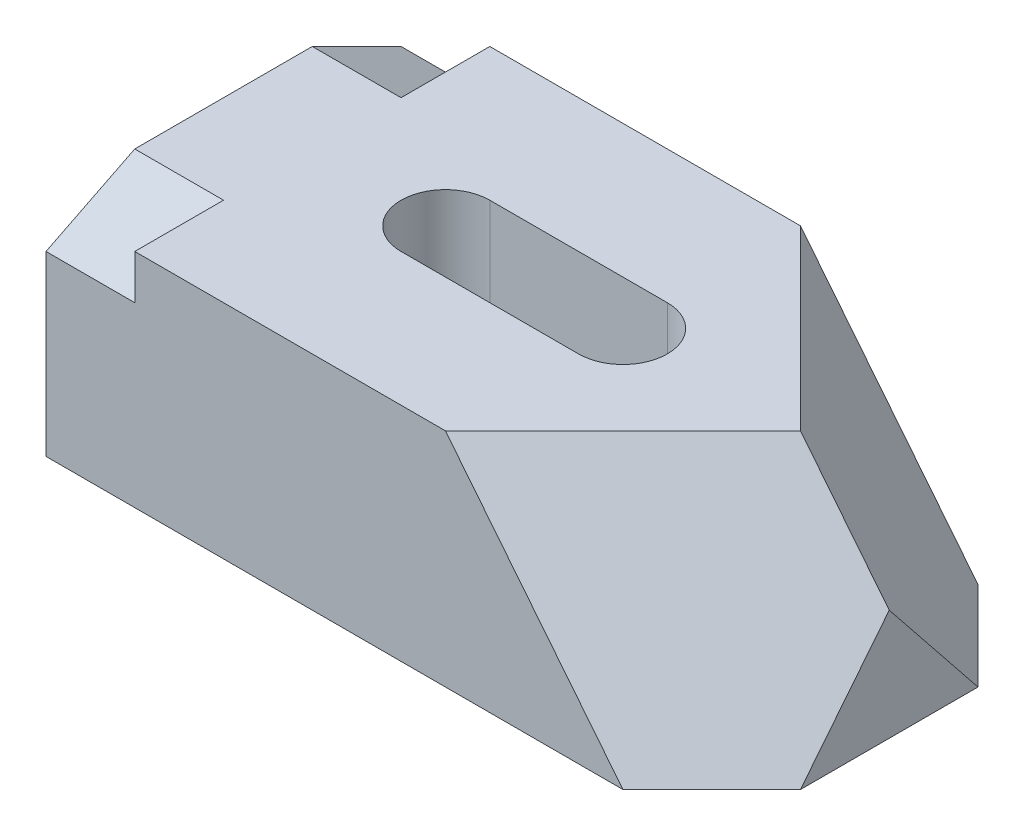
ISO-10303-21;
HEADER;
FILE_DESCRIPTION(('STEP AP214'),'2;1');
FILE_NAME('part.step','',(''),(''),'','','');
FILE_SCHEMA(('AUTOMOTIVE_DESIGN { 1 0 10303 214 1 1 1 1 }'));
ENDSEC;
DATA;
#1=APPLICATION_CONTEXT('core data for automotive mechanical design processes');
#2=APPLICATION_PROTOCOL_DEFINITION('international standard','automotive_design',2000,#1);
#3=PRODUCT_CONTEXT('',#1,'mechanical');
#4=PRODUCT('Part','Part','',(#3));
#5=PRODUCT_RELATED_PRODUCT_CATEGORY('part','',(#4));
#6=PRODUCT_DEFINITION_FORMATION('','',#4);
#7=PRODUCT_DEFINITION_CONTEXT('part definition',#1,'design');
#8=PRODUCT_DEFINITION('design','',#6,#7);
#9=PRODUCT_DEFINITION_SHAPE('','',#8);
#10=(LENGTH_UNIT() NAMED_UNIT(*) SI_UNIT(.MILLI.,.METRE.));
#11=(NAMED_UNIT(*) PLANE_ANGLE_UNIT() SI_UNIT($,.RADIAN.));
#12=(NAMED_UNIT(*) SI_UNIT($,.STERADIAN.) SOLID_ANGLE_UNIT());
#13=UNCERTAINTY_MEASURE_WITH_UNIT(LENGTH_MEASURE(1.E-05),#10,'distance_accuracy_value','');
#14=(GEOMETRIC_REPRESENTATION_CONTEXT(3) GLOBAL_UNCERTAINTY_ASSIGNED_CONTEXT((#13)) GLOBAL_UNIT_ASSIGNED_CONTEXT((#10,
#11,#12)) REPRESENTATION_CONTEXT('',''));
#15=CARTESIAN_POINT('',(0.,0.,0.));
#16=DIRECTION('',(0.,0.,1.));
#17=DIRECTION('',(1.,0.,0.));
#18=AXIS2_PLACEMENT_3D('',#15,#16,#17);
#19=CARTESIAN_POINT('',(45.,0.,-20.));
#20=DIRECTION('',(0.,1.,0.));
#21=DIRECTION('',(0.,0.,1.));
#22=AXIS2_PLACEMENT_3D('',#19,#20,#21);
#23=CYLINDRICAL_SURFACE('',#22,5.);
#24=DIRECTION('',(0.,1.,0.));
#25=VECTOR('',#24,1.);
#26=CARTESIAN_POINT('',(45.,0.,-15.));
#27=LINE('',#26,#25);
#28=CARTESIAN_POINT('',(45.,0.,-15.));
#29=VERTEX_POINT('',#28);
#30=CARTESIAN_POINT('',(45.,25.,-15.));
#31=VERTEX_POINT('',#30);
#32=EDGE_CURVE('E448',#29,#31,#27,.T.);
#33=ORIENTED_EDGE('',*,*,#32,.T.);
#34=CARTESIAN_POINT('',(45.,25.,-20.));
#35=DIRECTION('',(0.,1.,0.));
#36=DIRECTION('',(0.,0.,1.));
#37=AXIS2_PLACEMENT_3D('',#34,#35,#36);
#38=CIRCLE('',#37,5.);
#39=CARTESIAN_POINT('',(45.,25.,-25.));
#40=VERTEX_POINT('',#39);
#41=EDGE_CURVE('E174',#31,#40,#38,.T.);
#42=ORIENTED_EDGE('',*,*,#41,.T.);
#43=DIRECTION('',(0.,1.,0.));
#44=VECTOR('',#43,1.);
#45=CARTESIAN_POINT('',(45.,0.,-25.));
#46=LINE('',#45,#44);
#47=CARTESIAN_POINT('',(45.,0.,-25.));
#48=VERTEX_POINT('',#47);
#49=EDGE_CURVE('E148',#48,#40,#46,.T.);
#50=ORIENTED_EDGE('',*,*,#49,.F.);
#51=CARTESIAN_POINT('',(45.,0.,-20.));
#52=DIRECTION('',(0.,1.,0.));
#53=DIRECTION('',(0.,0.,1.));
#54=AXIS2_PLACEMENT_3D('',#51,#52,#53);
#55=CIRCLE('',#54,5.);
#56=EDGE_CURVE('E158',#29,#48,#55,.T.);
#57=ORIENTED_EDGE('',*,*,#56,.F.);
#58=EDGE_LOOP('',(#33,#42,#50,#57));
#59=FACE_BOUND('',#58,.T.);
#60=ADVANCED_FACE('F39',(#59),#23,.F.);
#61=CARTESIAN_POINT('',(0.,25.,0.));
#62=DIRECTION('',(0.,0.,-1.));
#63=DIRECTION('',(-1.,0.,0.));
#64=AXIS2_PLACEMENT_3D('',#61,#62,#63);
#65=PLANE('',#64);
#66=DIRECTION('',(0.,1.,0.));
#67=VECTOR('',#66,1.);
#68=CARTESIAN_POINT('',(10.,20.,0.));
#69=LINE('',#68,#67);
#70=CARTESIAN_POINT('',(10.,20.,0.));
#71=VERTEX_POINT('',#70);
#72=CARTESIAN_POINT('',(10.,25.,0.));
#73=VERTEX_POINT('',#72);
#74=EDGE_CURVE('E203',#71,#73,#69,.T.);
#75=ORIENTED_EDGE('',*,*,#74,.F.);
#76=DIRECTION('',(-1.,0.,0.));
#77=VECTOR('',#76,1.);
#78=CARTESIAN_POINT('',(10.,20.,0.));
#79=LINE('',#78,#77);
#80=CARTESIAN_POINT('',(0.,20.,0.));
#81=VERTEX_POINT('',#80);
#82=EDGE_CURVE('E209',#71,#81,#79,.T.);
#83=ORIENTED_EDGE('',*,*,#82,.T.);
#84=DIRECTION('',(0.,-1.,0.));
#85=VECTOR('',#84,1.);
#86=CARTESIAN_POINT('',(0.,25.,0.));
#87=LINE('',#86,#85);
#88=CARTESIAN_POINT('',(0.,0.,0.));
#89=VERTEX_POINT('',#88);
#90=EDGE_CURVE('E271',#81,#89,#87,.T.);
#91=ORIENTED_EDGE('',*,*,#90,.T.);
#92=DIRECTION('',(1.,0.,0.));
#93=VECTOR('',#92,1.);
#94=CARTESIAN_POINT('',(0.,0.,0.));
#95=LINE('',#94,#93);
#96=CARTESIAN_POINT('',(65.,0.,0.));
#97=VERTEX_POINT('',#96);
#98=EDGE_CURVE('E258',#89,#97,#95,.T.);
#99=ORIENTED_EDGE('',*,*,#98,.T.);
#100=DIRECTION('',(0.624695047554425,-0.78086880944303,0.));
#101=VECTOR('',#100,1.);
#102=CARTESIAN_POINT('',(27.4390243902439,46.9512195121951,0.));
#103=LINE('',#102,#101);
#104=CARTESIAN_POINT('',(45.,25.,0.));
#105=VERTEX_POINT('',#104);
#106=EDGE_CURVE('E235',#105,#97,#103,.T.);
#107=ORIENTED_EDGE('',*,*,#106,.F.);
#108=DIRECTION('',(1.,0.,0.));
#109=VECTOR('',#108,1.);
#110=CARTESIAN_POINT('',(0.,25.,0.));
#111=LINE('',#110,#109);
#112=EDGE_CURVE('E246',#73,#105,#111,.T.);
#113=ORIENTED_EDGE('',*,*,#112,.F.);
#114=EDGE_LOOP('',(#75,#83,#91,#99,#107,#113));
#115=FACE_BOUND('',#114,.T.);
#116=ADVANCED_FACE('F284',(#115),#65,.F.);
#117=CARTESIAN_POINT('',(75.,25.,0.));
#118=DIRECTION('',(-1.,0.,0.));
#119=DIRECTION('',(0.,0.,1.));
#120=AXIS2_PLACEMENT_3D('',#117,#118,#119);
#121=PLANE('',#120);
#122=DIRECTION('',(0.,0.,-1.));
#123=VECTOR('',#122,1.);
#124=CARTESIAN_POINT('',(75.,0.,0.));
#125=LINE('',#124,#123);
#126=CARTESIAN_POINT('',(75.,0.,-9.99999999999997));
#127=VERTEX_POINT('',#126);
#128=CARTESIAN_POINT('',(75.,0.,-30.));
#129=VERTEX_POINT('',#128);
#130=EDGE_CURVE('E262',#127,#129,#125,.T.);
#131=ORIENTED_EDGE('',*,*,#130,.T.);
#132=DIRECTION('',(0.,0.780868809443029,0.624695047554426));
#133=VECTOR('',#132,1.);
#134=CARTESIAN_POINT('',(75.,29.8780487804878,-6.09756097560968));
#135=LINE('',#134,#133);
#136=CARTESIAN_POINT('',(75.,12.5,-20.));
#137=VERTEX_POINT('',#136);
#138=EDGE_CURVE('E220',#129,#137,#135,.T.);
#139=ORIENTED_EDGE('',*,*,#138,.T.);
#140=DIRECTION('',(0.,0.78086880944303,-0.624695047554425));
#141=VECTOR('',#140,1.);
#142=CARTESIAN_POINT('',(75.,10.3658536585366,-18.2926829268293));
#143=LINE('',#142,#141);
#144=EDGE_CURVE('E231',#127,#137,#143,.T.);
#145=ORIENTED_EDGE('',*,*,#144,.F.);
#146=EDGE_LOOP('',(#131,#139,#145));
#147=FACE_BOUND('',#146,.T.);
#148=ADVANCED_FACE('F308',(#147),#121,.F.);
#149=CARTESIAN_POINT('',(0.,25.,0.));
#150=DIRECTION('',(0.,-1.,0.));
#151=DIRECTION('',(0.,0.,-1.));
#152=AXIS2_PLACEMENT_3D('',#149,#150,#151);
#153=PLANE('',#152);
#154=ORIENTED_EDGE('',*,*,#41,.F.);
#155=DIRECTION('',(1.,0.,0.));
#156=VECTOR('',#155,1.);
#157=CARTESIAN_POINT('',(45.,25.,-15.));
#158=LINE('',#157,#156);
#159=CARTESIAN_POINT('',(25.,25.,-15.));
#160=VERTEX_POINT('',#159);
#161=EDGE_CURVE('E55',#160,#31,#158,.T.);
#162=ORIENTED_EDGE('',*,*,#161,.F.);
#163=CARTESIAN_POINT('',(25.,25.,-20.));
#164=DIRECTION('',(0.,1.,0.));
#165=DIRECTION('',(0.,0.,1.));
#166=AXIS2_PLACEMENT_3D('',#163,#164,#165);
#167=CIRCLE('',#166,5.);
#168=CARTESIAN_POINT('',(25.,25.,-25.));
#169=VERTEX_POINT('',#168);
#170=EDGE_CURVE('E166',#169,#160,#167,.T.);
#171=ORIENTED_EDGE('',*,*,#170,.F.);
#172=DIRECTION('',(-1.,0.,0.));
#173=VECTOR('',#172,1.);
#174=CARTESIAN_POINT('',(45.,25.,-25.));
#175=LINE('',#174,#173);
#176=EDGE_CURVE('E141',#40,#169,#175,.T.);
#177=ORIENTED_EDGE('',*,*,#176,.F.);
#178=EDGE_LOOP('',(#154,#162,#171,#177));
#179=FACE_BOUND('',#178,.T.);
#180=DIRECTION('',(0.,0.,-1.));
#181=VECTOR('',#180,1.);
#182=CARTESIAN_POINT('',(10.,25.,-30.));
#183=LINE('',#182,#181);
#184=CARTESIAN_POINT('',(10.,25.,-30.));
#185=VERTEX_POINT('',#184);
#186=CARTESIAN_POINT('',(10.,25.,-40.));
#187=VERTEX_POINT('',#186);
#188=EDGE_CURVE('E184',#185,#187,#183,.T.);
#189=ORIENTED_EDGE('',*,*,#188,.F.);
#190=DIRECTION('',(-1.,0.,0.));
#191=VECTOR('',#190,1.);
#192=CARTESIAN_POINT('',(10.,25.,-30.));
#193=LINE('',#192,#191);
#194=CARTESIAN_POINT('',(0.,25.,-30.));
#195=VERTEX_POINT('',#194);
#196=EDGE_CURVE('E188',#185,#195,#193,.T.);
#197=ORIENTED_EDGE('',*,*,#196,.T.);
#198=DIRECTION('',(0.,0.,1.));
#199=VECTOR('',#198,1.);
#200=CARTESIAN_POINT('',(0.,25.,0.));
#201=LINE('',#200,#199);
#202=CARTESIAN_POINT('',(0.,25.,-10.));
#203=VERTEX_POINT('',#202);
#204=EDGE_CURVE('E243',#195,#203,#201,.T.);
#205=ORIENTED_EDGE('',*,*,#204,.T.);
#206=DIRECTION('',(-1.,0.,0.));
#207=VECTOR('',#206,1.);
#208=CARTESIAN_POINT('',(10.,25.,-10.));
#209=LINE('',#208,#207);
#210=CARTESIAN_POINT('',(10.,25.,-10.));
#211=VERTEX_POINT('',#210);
#212=EDGE_CURVE('E206',#211,#203,#209,.T.);
#213=ORIENTED_EDGE('',*,*,#212,.F.);
#214=DIRECTION('',(0.,0.,-1.));
#215=VECTOR('',#214,1.);
#216=CARTESIAN_POINT('',(10.,25.,0.));
#217=LINE('',#216,#215);
#218=EDGE_CURVE('E195',#73,#211,#217,.T.);
#219=ORIENTED_EDGE('',*,*,#218,.F.);
#220=ORIENTED_EDGE('',*,*,#112,.T.);
#221=DIRECTION('',(-0.707106781186547,0.,0.707106781186548));
#222=VECTOR('',#221,1.);
#223=CARTESIAN_POINT('',(22.5,25.,22.5));
#224=LINE('',#223,#222);
#225=CARTESIAN_POINT('',(65.,25.,-20.));
#226=VERTEX_POINT('',#225);
#227=EDGE_CURVE('E238',#226,#105,#224,.T.);
#228=ORIENTED_EDGE('',*,*,#227,.F.);
#229=DIRECTION('',(-0.707106781186546,0.,-0.707106781186549));
#230=VECTOR('',#229,1.);
#231=CARTESIAN_POINT('',(42.5000000000001,25.,-42.4999999999999));
#232=LINE('',#231,#230);
#233=CARTESIAN_POINT('',(45.,25.,-40.));
#234=VERTEX_POINT('',#233);
#235=EDGE_CURVE('E213',#226,#234,#232,.T.);
#236=ORIENTED_EDGE('',*,*,#235,.T.);
#237=DIRECTION('',(-1.,0.,0.));
#238=VECTOR('',#237,1.);
#239=CARTESIAN_POINT('',(0.,25.,-40.));
#240=LINE('',#239,#238);
#241=EDGE_CURVE('E250',#234,#187,#240,.T.);
#242=ORIENTED_EDGE('',*,*,#241,.T.);
#243=EDGE_LOOP('',(#189,#197,#205,#213,#219,#220,#228,#236,#242));
#244=FACE_BOUND('',#243,.T.);
#245=ADVANCED_FACE('F304',(#179,#244),#153,.F.);
#246=CARTESIAN_POINT('',(0.,0.,0.));
#247=DIRECTION('',(0.,-1.,0.));
#248=DIRECTION('',(0.,0.,-1.));
#249=AXIS2_PLACEMENT_3D('',#246,#247,#248);
#250=PLANE('',#249);
#251=DIRECTION('',(1.,0.,0.));
#252=VECTOR('',#251,1.);
#253=CARTESIAN_POINT('',(45.,0.,-15.));
#254=LINE('',#253,#252);
#255=CARTESIAN_POINT('',(25.,0.,-15.));
#256=VERTEX_POINT('',#255);
#257=EDGE_CURVE('E160',#256,#29,#254,.T.);
#258=ORIENTED_EDGE('',*,*,#257,.T.);
#259=ORIENTED_EDGE('',*,*,#56,.T.);
#260=DIRECTION('',(-1.,0.,0.));
#261=VECTOR('',#260,1.);
#262=CARTESIAN_POINT('',(45.,0.,-25.));
#263=LINE('',#262,#261);
#264=CARTESIAN_POINT('',(25.,0.,-25.));
#265=VERTEX_POINT('',#264);
#266=EDGE_CURVE('E63',#48,#265,#263,.T.);
#267=ORIENTED_EDGE('',*,*,#266,.T.);
#268=CARTESIAN_POINT('',(25.,0.,-20.));
#269=DIRECTION('',(0.,1.,0.));
#270=DIRECTION('',(0.,0.,1.));
#271=AXIS2_PLACEMENT_3D('',#268,#269,#270);
#272=CIRCLE('',#271,5.);
#273=EDGE_CURVE('E156',#265,#256,#272,.T.);
#274=ORIENTED_EDGE('',*,*,#273,.T.);
#275=EDGE_LOOP('',(#258,#259,#267,#274));
#276=FACE_BOUND('',#275,.T.);
#277=DIRECTION('',(-0.707106781186546,0.,-0.707106781186549));
#278=VECTOR('',#277,1.);
#279=CARTESIAN_POINT('',(52.5000000000001,0.,-52.4999999999999));
#280=LINE('',#279,#278);
#281=CARTESIAN_POINT('',(65.,0.,-40.));
#282=VERTEX_POINT('',#281);
#283=EDGE_CURVE('E228',#129,#282,#280,.T.);
#284=ORIENTED_EDGE('',*,*,#283,.F.);
#285=ORIENTED_EDGE('',*,*,#130,.F.);
#286=DIRECTION('',(-0.707106781186547,0.,0.707106781186548));
#287=VECTOR('',#286,1.);
#288=CARTESIAN_POINT('',(32.5,0.,32.5));
#289=LINE('',#288,#287);
#290=EDGE_CURVE('E48',#127,#97,#289,.T.);
#291=ORIENTED_EDGE('',*,*,#290,.T.);
#292=ORIENTED_EDGE('',*,*,#98,.F.);
#293=DIRECTION('',(0.,0.,1.));
#294=VECTOR('',#293,1.);
#295=CARTESIAN_POINT('',(0.,0.,0.));
#296=LINE('',#295,#294);
#297=CARTESIAN_POINT('',(0.,0.,-40.));
#298=VERTEX_POINT('',#297);
#299=EDGE_CURVE('E242',#298,#89,#296,.T.);
#300=ORIENTED_EDGE('',*,*,#299,.F.);
#301=DIRECTION('',(-1.,0.,0.));
#302=VECTOR('',#301,1.);
#303=CARTESIAN_POINT('',(0.,0.,-40.));
#304=LINE('',#303,#302);
#305=EDGE_CURVE('E247',#282,#298,#304,.T.);
#306=ORIENTED_EDGE('',*,*,#305,.F.);
#307=EDGE_LOOP('',(#284,#285,#291,#292,#300,#306));
#308=FACE_BOUND('',#307,.T.);
#309=ADVANCED_FACE('F154',(#276,#308),#250,.T.);
#310=CARTESIAN_POINT('',(0.,25.,0.));
#311=DIRECTION('',(1.,0.,0.));
#312=DIRECTION('',(0.,0.,-1.));
#313=AXIS2_PLACEMENT_3D('',#310,#311,#312);
#314=PLANE('',#313);
#315=ORIENTED_EDGE('',*,*,#204,.F.);
#316=DIRECTION('',(0.,0.447213595499958,0.894427190999916));
#317=VECTOR('',#316,1.);
#318=CARTESIAN_POINT('',(0.,20.,-40.));
#319=LINE('',#318,#317);
#320=CARTESIAN_POINT('',(0.,20.,-40.));
#321=VERTEX_POINT('',#320);
#322=EDGE_CURVE('E165',#321,#195,#319,.T.);
#323=ORIENTED_EDGE('',*,*,#322,.F.);
#324=DIRECTION('',(0.,-1.,0.));
#325=VECTOR('',#324,1.);
#326=CARTESIAN_POINT('',(0.,25.,-40.));
#327=LINE('',#326,#325);
#328=EDGE_CURVE('E254',#321,#298,#327,.T.);
#329=ORIENTED_EDGE('',*,*,#328,.T.);
#330=ORIENTED_EDGE('',*,*,#299,.T.);
#331=ORIENTED_EDGE('',*,*,#90,.F.);
#332=DIRECTION('',(0.,-0.447213595499958,0.894427190999916));
#333=VECTOR('',#332,1.);
#334=CARTESIAN_POINT('',(0.,25.,-10.));
#335=LINE('',#334,#333);
#336=EDGE_CURVE('E192',#203,#81,#335,.T.);
#337=ORIENTED_EDGE('',*,*,#336,.F.);
#338=EDGE_LOOP('',(#315,#323,#329,#330,#331,#337));
#339=FACE_BOUND('',#338,.T.);
#340=ADVANCED_FACE('F41',(#339),#314,.F.);
#341=CARTESIAN_POINT('',(0.,25.,-40.));
#342=DIRECTION('',(0.,0.,1.));
#343=DIRECTION('',(1.,0.,0.));
#344=AXIS2_PLACEMENT_3D('',#341,#342,#343);
#345=PLANE('',#344);
#346=ORIENTED_EDGE('',*,*,#328,.F.);
#347=DIRECTION('',(-1.,0.,0.));
#348=VECTOR('',#347,1.);
#349=CARTESIAN_POINT('',(10.,20.,-40.));
#350=LINE('',#349,#348);
#351=CARTESIAN_POINT('',(10.,20.,-40.));
#352=VERTEX_POINT('',#351);
#353=EDGE_CURVE('E186',#352,#321,#350,.T.);
#354=ORIENTED_EDGE('',*,*,#353,.F.);
#355=DIRECTION('',(0.,-1.,0.));
#356=VECTOR('',#355,1.);
#357=CARTESIAN_POINT('',(10.,25.,-40.));
#358=LINE('',#357,#356);
#359=EDGE_CURVE('E170',#187,#352,#358,.T.);
#360=ORIENTED_EDGE('',*,*,#359,.F.);
#361=ORIENTED_EDGE('',*,*,#241,.F.);
#362=DIRECTION('',(0.624695047554425,-0.78086880944303,0.));
#363=VECTOR('',#362,1.);
#364=CARTESIAN_POINT('',(27.4390243902439,46.9512195121951,-40.));
#365=LINE('',#364,#363);
#366=EDGE_CURVE('E224',#234,#282,#365,.T.);
#367=ORIENTED_EDGE('',*,*,#366,.T.);
#368=ORIENTED_EDGE('',*,*,#305,.T.);
#369=EDGE_LOOP('',(#346,#354,#360,#361,#367,#368));
#370=FACE_BOUND('',#369,.T.);
#371=ADVANCED_FACE('F294',(#370),#345,.F.);
#372=CARTESIAN_POINT('',(24.6212121212121,19.6969696969697,24.6212121212121));
#373=DIRECTION('',(0.615457454896664,0.492365963917331,0.615457454896663));
#374=DIRECTION('',(0.707106781186547,0.,-0.707106781186548));
#375=AXIS2_PLACEMENT_3D('',#372,#373,#374);
#376=PLANE('',#375);
#377=DIRECTION('',(0.624695047554425,-0.78086880944303,0.));
#378=VECTOR('',#377,1.);
#379=CARTESIAN_POINT('',(51.8292682926829,41.4634146341463,-20.));
#380=LINE('',#379,#378);
#381=EDGE_CURVE('E11',#226,#137,#380,.T.);
#382=ORIENTED_EDGE('',*,*,#381,.F.);
#383=ORIENTED_EDGE('',*,*,#227,.T.);
#384=ORIENTED_EDGE('',*,*,#106,.T.);
#385=ORIENTED_EDGE('',*,*,#290,.F.);
#386=ORIENTED_EDGE('',*,*,#144,.T.);
#387=EDGE_LOOP('',(#382,#383,#384,#385,#386));
#388=FACE_BOUND('',#387,.T.);
#389=ADVANCED_FACE('F306',(#388),#376,.T.);
#390=CARTESIAN_POINT('',(39.7727272727273,31.8181818181819,-39.7727272727272));
#391=DIRECTION('',(-0.615457454896664,-0.492365963917332,0.615457454896662));
#392=DIRECTION('',(0.707106781186546,0.,0.707106781186549));
#393=AXIS2_PLACEMENT_3D('',#390,#391,#392);
#394=PLANE('',#393);
#395=ORIENTED_EDGE('',*,*,#283,.T.);
#396=ORIENTED_EDGE('',*,*,#366,.F.);
#397=ORIENTED_EDGE('',*,*,#235,.F.);
#398=ORIENTED_EDGE('',*,*,#381,.T.);
#399=ORIENTED_EDGE('',*,*,#138,.F.);
#400=EDGE_LOOP('',(#395,#396,#397,#398,#399));
#401=FACE_BOUND('',#400,.T.);
#402=ADVANCED_FACE('F299',(#401),#394,.F.);
#403=CARTESIAN_POINT('',(10.,25.,-10.));
#404=DIRECTION('',(0.,-0.894427190999916,-0.447213595499958));
#405=DIRECTION('',(0.,0.447213595499958,-0.894427190999916));
#406=AXIS2_PLACEMENT_3D('',#403,#404,#405);
#407=PLANE('',#406);
#408=ORIENTED_EDGE('',*,*,#336,.T.);
#409=ORIENTED_EDGE('',*,*,#82,.F.);
#410=DIRECTION('',(0.,-0.447213595499958,0.894427190999916));
#411=VECTOR('',#410,1.);
#412=CARTESIAN_POINT('',(10.,25.,-10.));
#413=LINE('',#412,#411);
#414=EDGE_CURVE('E199',#211,#71,#413,.T.);
#415=ORIENTED_EDGE('',*,*,#414,.F.);
#416=ORIENTED_EDGE('',*,*,#212,.T.);
#417=EDGE_LOOP('',(#408,#409,#415,#416));
#418=FACE_BOUND('',#417,.T.);
#419=ADVANCED_FACE('F339',(#418),#407,.F.);
#420=CARTESIAN_POINT('',(10.,0.,0.));
#421=DIRECTION('',(1.,0.,0.));
#422=DIRECTION('',(0.,0.,-1.));
#423=AXIS2_PLACEMENT_3D('',#420,#421,#422);
#424=PLANE('',#423);
#425=ORIENTED_EDGE('',*,*,#218,.T.);
#426=ORIENTED_EDGE('',*,*,#414,.T.);
#427=ORIENTED_EDGE('',*,*,#74,.T.);
#428=EDGE_LOOP('',(#425,#426,#427));
#429=FACE_BOUND('',#428,.T.);
#430=ADVANCED_FACE('F335',(#429),#424,.F.);
#431=CARTESIAN_POINT('',(10.,20.,-40.));
#432=DIRECTION('',(0.,-0.894427190999916,0.447213595499958));
#433=DIRECTION('',(0.,-0.447213595499958,-0.894427190999916));
#434=AXIS2_PLACEMENT_3D('',#431,#432,#433);
#435=PLANE('',#434);
#436=ORIENTED_EDGE('',*,*,#322,.T.);
#437=ORIENTED_EDGE('',*,*,#196,.F.);
#438=DIRECTION('',(0.,0.447213595499958,0.894427190999916));
#439=VECTOR('',#438,1.);
#440=CARTESIAN_POINT('',(10.,20.,-40.));
#441=LINE('',#440,#439);
#442=EDGE_CURVE('E180',#352,#185,#441,.T.);
#443=ORIENTED_EDGE('',*,*,#442,.F.);
#444=ORIENTED_EDGE('',*,*,#353,.T.);
#445=EDGE_LOOP('',(#436,#437,#443,#444));
#446=FACE_BOUND('',#445,.T.);
#447=ADVANCED_FACE('F331',(#446),#435,.F.);
#448=CARTESIAN_POINT('',(10.,0.,0.));
#449=DIRECTION('',(1.,0.,0.));
#450=DIRECTION('',(0.,0.,-1.));
#451=AXIS2_PLACEMENT_3D('',#448,#449,#450);
#452=PLANE('',#451);
#453=ORIENTED_EDGE('',*,*,#359,.T.);
#454=ORIENTED_EDGE('',*,*,#442,.T.);
#455=ORIENTED_EDGE('',*,*,#188,.T.);
#456=EDGE_LOOP('',(#453,#454,#455));
#457=FACE_BOUND('',#456,.T.);
#458=ADVANCED_FACE('F328',(#457),#452,.F.);
#459=CARTESIAN_POINT('',(25.,0.,-20.));
#460=DIRECTION('',(0.,1.,0.));
#461=DIRECTION('',(0.,0.,1.));
#462=AXIS2_PLACEMENT_3D('',#459,#460,#461);
#463=CYLINDRICAL_SURFACE('',#462,5.);
#464=ORIENTED_EDGE('',*,*,#170,.T.);
#465=DIRECTION('',(0.,1.,0.));
#466=VECTOR('',#465,1.);
#467=CARTESIAN_POINT('',(25.,0.,-15.));
#468=LINE('',#467,#466);
#469=EDGE_CURVE('E147',#256,#160,#468,.T.);
#470=ORIENTED_EDGE('',*,*,#469,.F.);
#471=ORIENTED_EDGE('',*,*,#273,.F.);
#472=DIRECTION('',(0.,1.,0.));
#473=VECTOR('',#472,1.);
#474=CARTESIAN_POINT('',(25.,0.,-25.));
#475=LINE('',#474,#473);
#476=EDGE_CURVE('E138',#265,#169,#475,.T.);
#477=ORIENTED_EDGE('',*,*,#476,.T.);
#478=EDGE_LOOP('',(#464,#470,#471,#477));
#479=FACE_BOUND('',#478,.T.);
#480=ADVANCED_FACE('F163',(#479),#463,.F.);
#481=CARTESIAN_POINT('',(45.,0.,-25.));
#482=DIRECTION('',(0.,0.,-1.));
#483=DIRECTION('',(-1.,0.,0.));
#484=AXIS2_PLACEMENT_3D('',#481,#482,#483);
#485=PLANE('',#484);
#486=ORIENTED_EDGE('',*,*,#176,.T.);
#487=ORIENTED_EDGE('',*,*,#476,.F.);
#488=ORIENTED_EDGE('',*,*,#266,.F.);
#489=ORIENTED_EDGE('',*,*,#49,.T.);
#490=EDGE_LOOP('',(#486,#487,#488,#489));
#491=FACE_BOUND('',#490,.T.);
#492=ADVANCED_FACE('F139',(#491),#485,.F.);
#493=CARTESIAN_POINT('',(45.,0.,-15.));
#494=DIRECTION('',(0.,0.,1.));
#495=DIRECTION('',(1.,0.,0.));
#496=AXIS2_PLACEMENT_3D('',#493,#494,#495);
#497=PLANE('',#496);
#498=ORIENTED_EDGE('',*,*,#161,.T.);
#499=ORIENTED_EDGE('',*,*,#32,.F.);
#500=ORIENTED_EDGE('',*,*,#257,.F.);
#501=ORIENTED_EDGE('',*,*,#469,.T.);
#502=EDGE_LOOP('',(#498,#499,#500,#501));
#503=FACE_BOUND('',#502,.T.);
#504=ADVANCED_FACE('F434',(#503),#497,.F.);
#505=CLOSED_SHELL('',(#60,#116,#148,#245,#309,#340,#371,#389,#402,#419,#430,#447,#458,#480,#492,#504));
#506=MANIFOLD_SOLID_BREP('B2',#505);
#507=ADVANCED_BREP_SHAPE_REPRESENTATION('',(#18,#506),#14);
#508=SHAPE_DEFINITION_REPRESENTATION(#9,#507);
ENDSEC;
END-ISO-10303-21;
